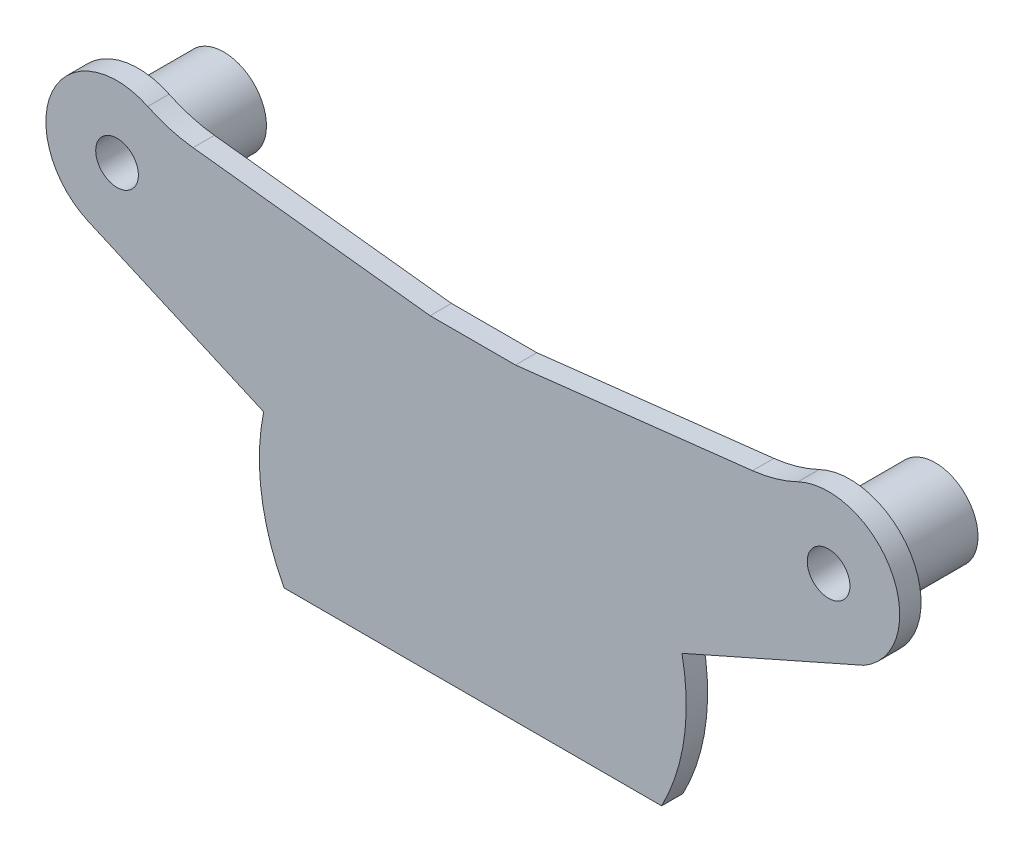
ISO-10303-21;
HEADER;
FILE_DESCRIPTION(('STEP AP214'),'2;1');
FILE_NAME('part.step','',(''),(''),'','','');
FILE_SCHEMA(('AUTOMOTIVE_DESIGN { 1 0 10303 214 1 1 1 1 }'));
ENDSEC;
DATA;
#1=APPLICATION_CONTEXT('core data for automotive mechanical design processes');
#2=APPLICATION_PROTOCOL_DEFINITION('international standard','automotive_design',2000,#1);
#3=PRODUCT_CONTEXT('',#1,'mechanical');
#4=PRODUCT('Part','Part','',(#3));
#5=PRODUCT_RELATED_PRODUCT_CATEGORY('part','',(#4));
#6=PRODUCT_DEFINITION_FORMATION('','',#4);
#7=PRODUCT_DEFINITION_CONTEXT('part definition',#1,'design');
#8=PRODUCT_DEFINITION('design','',#6,#7);
#9=PRODUCT_DEFINITION_SHAPE('','',#8);
#10=(LENGTH_UNIT() NAMED_UNIT(*) SI_UNIT(.MILLI.,.METRE.));
#11=(NAMED_UNIT(*) PLANE_ANGLE_UNIT() SI_UNIT($,.RADIAN.));
#12=(NAMED_UNIT(*) SI_UNIT($,.STERADIAN.) SOLID_ANGLE_UNIT());
#13=UNCERTAINTY_MEASURE_WITH_UNIT(LENGTH_MEASURE(1.E-05),#10,'distance_accuracy_value','');
#14=(GEOMETRIC_REPRESENTATION_CONTEXT(3) GLOBAL_UNCERTAINTY_ASSIGNED_CONTEXT((#13)) GLOBAL_UNIT_ASSIGNED_CONTEXT((#10,
#11,#12)) REPRESENTATION_CONTEXT('',''));
#15=CARTESIAN_POINT('',(0.,0.,0.));
#16=DIRECTION('',(0.,0.,1.));
#17=DIRECTION('',(1.,0.,0.));
#18=AXIS2_PLACEMENT_3D('',#15,#16,#17);
#19=CARTESIAN_POINT('',(0.,0.,0.));
#20=DIRECTION('',(0.,0.,1.));
#21=DIRECTION('',(1.,0.,0.));
#22=AXIS2_PLACEMENT_3D('',#19,#20,#21);
#23=PLANE('',#22);
#24=CARTESIAN_POINT('',(-25.,13.,0.));
#25=DIRECTION('',(0.,0.,1.));
#26=DIRECTION('',(1.,0.,0.));
#27=AXIS2_PLACEMENT_3D('',#24,#25,#26);
#28=CIRCLE('',#27,4.00000000000001);
#29=CARTESIAN_POINT('',(-21.,13.,0.));
#30=VERTEX_POINT('',#29);
#31=EDGE_CURVE('E45',#30,#30,#28,.T.);
#32=ORIENTED_EDGE('',*,*,#31,.T.);
#33=EDGE_LOOP('',(#32));
#34=FACE_BOUND('',#33,.T.);
#35=CARTESIAN_POINT('',(25.,13.,0.));
#36=DIRECTION('',(0.,0.,1.));
#37=DIRECTION('',(1.,0.,0.));
#38=AXIS2_PLACEMENT_3D('',#35,#36,#37);
#39=CIRCLE('',#38,4.00000000000001);
#40=CARTESIAN_POINT('',(29.,13.,0.));
#41=VERTEX_POINT('',#40);
#42=EDGE_CURVE('E217',#41,#41,#39,.T.);
#43=ORIENTED_EDGE('',*,*,#42,.T.);
#44=EDGE_LOOP('',(#43));
#45=FACE_BOUND('',#44,.T.);
#46=CARTESIAN_POINT('',(-18.5250325634357,26.5305135414526,0.));
#47=DIRECTION('',(0.,0.,1.));
#48=DIRECTION('',(1.,0.,0.));
#49=AXIS2_PLACEMENT_3D('',#46,#47,#48);
#50=CIRCLE('',#49,10.);
#51=CARTESIAN_POINT('',(-22.8416775211452,17.5101711804842,0.));
#52=VERTEX_POINT('',#51);
#53=CARTESIAN_POINT('',(-19.657078673607,16.5947965766611,0.));
#54=VERTEX_POINT('',#53);
#55=EDGE_CURVE('E163',#52,#54,#50,.T.);
#56=ORIENTED_EDGE('',*,*,#55,.T.);
#57=DIRECTION('',(0.993571696479152,-0.113204611017127,0.));
#58=VECTOR('',#57,1.);
#59=CARTESIAN_POINT('',(1.61462018727957,14.1711623248467,0.));
#60=LINE('',#59,#58);
#61=CARTESIAN_POINT('',(-3.,14.6969384566991,0.));
#62=VERTEX_POINT('',#61);
#63=EDGE_CURVE('E188',#54,#62,#60,.T.);
#64=ORIENTED_EDGE('',*,*,#63,.T.);
#65=DIRECTION('',(1.,0.,0.));
#66=VECTOR('',#65,1.);
#67=CARTESIAN_POINT('',(0.,14.6969384566991,0.));
#68=LINE('',#67,#66);
#69=CARTESIAN_POINT('',(3.,14.6969384566991,0.));
#70=VERTEX_POINT('',#69);
#71=EDGE_CURVE('E186',#62,#70,#68,.T.);
#72=ORIENTED_EDGE('',*,*,#71,.T.);
#73=DIRECTION('',(0.993571696479152,0.113204611017128,0.));
#74=VECTOR('',#73,1.);
#75=CARTESIAN_POINT('',(-1.61462018727957,14.1711623248467,0.));
#76=LINE('',#75,#74);
#77=CARTESIAN_POINT('',(19.657078673607,16.5947965766611,0.));
#78=VERTEX_POINT('',#77);
#79=EDGE_CURVE('E134',#70,#78,#76,.T.);
#80=ORIENTED_EDGE('',*,*,#79,.T.);
#81=CARTESIAN_POINT('',(18.5250325634357,26.5305135414526,0.));
#82=DIRECTION('',(0.,0.,1.));
#83=DIRECTION('',(1.,0.,0.));
#84=AXIS2_PLACEMENT_3D('',#81,#82,#83);
#85=CIRCLE('',#84,10.);
#86=CARTESIAN_POINT('',(22.8416775211452,17.5101711804842,0.));
#87=VERTEX_POINT('',#86);
#88=EDGE_CURVE('E182',#78,#87,#85,.T.);
#89=ORIENTED_EDGE('',*,*,#88,.T.);
#90=CARTESIAN_POINT('',(25.,13.,0.));
#91=DIRECTION('',(0.,0.,1.));
#92=DIRECTION('',(1.,0.,0.));
#93=AXIS2_PLACEMENT_3D('',#90,#91,#92);
#94=CIRCLE('',#93,5.);
#95=CARTESIAN_POINT('',(27.4936388626549,8.66620660129523,0.));
#96=VERTEX_POINT('',#95);
#97=EDGE_CURVE('E179',#96,#87,#94,.T.);
#98=ORIENTED_EDGE('',*,*,#97,.F.);
#99=DIRECTION('',(0.914373292540075,0.404872179693077,0.));
#100=VECTOR('',#99,1.);
#101=CARTESIAN_POINT('',(1.29853100704825,-2.9326343768055,0.));
#102=LINE('',#101,#100);
#103=CARTESIAN_POINT('',(14.6969384566991,3.,0.));
#104=VERTEX_POINT('',#103);
#105=EDGE_CURVE('E177',#104,#96,#102,.T.);
#106=ORIENTED_EDGE('',*,*,#105,.F.);
#107=CARTESIAN_POINT('',(0.,0.,0.));
#108=DIRECTION('',(0.,0.,1.));
#109=DIRECTION('',(1.,0.,0.));
#110=AXIS2_PLACEMENT_3D('',#107,#108,#109);
#111=CIRCLE('',#110,15.);
#112=CARTESIAN_POINT('',(13.2664991614216,-7.,0.));
#113=VERTEX_POINT('',#112);
#114=EDGE_CURVE('E175',#113,#104,#111,.T.);
#115=ORIENTED_EDGE('',*,*,#114,.F.);
#116=DIRECTION('',(1.,0.,0.));
#117=VECTOR('',#116,1.);
#118=CARTESIAN_POINT('',(0.,-7.,0.));
#119=LINE('',#118,#117);
#120=CARTESIAN_POINT('',(-13.2664991614216,-7.,0.));
#121=VERTEX_POINT('',#120);
#122=EDGE_CURVE('E174',#121,#113,#119,.T.);
#123=ORIENTED_EDGE('',*,*,#122,.F.);
#124=CARTESIAN_POINT('',(-14.6969384566991,3.,0.));
#125=VERTEX_POINT('',#124);
#126=EDGE_CURVE('E172',#125,#121,#111,.T.);
#127=ORIENTED_EDGE('',*,*,#126,.F.);
#128=DIRECTION('',(-0.915203990948097,0.402990886935022,0.));
#129=VECTOR('',#128,1.);
#130=CARTESIAN_POINT('',(-1.28035052398962,-2.90771317009142,0.));
#131=LINE('',#130,#129);
#132=CARTESIAN_POINT('',(-27.0149544346751,8.42398004525951,0.));
#133=VERTEX_POINT('',#132);
#134=EDGE_CURVE('E169',#125,#133,#131,.T.);
#135=ORIENTED_EDGE('',*,*,#134,.T.);
#136=CARTESIAN_POINT('',(-25.,13.,0.));
#137=DIRECTION('',(0.,0.,1.));
#138=DIRECTION('',(1.,0.,0.));
#139=AXIS2_PLACEMENT_3D('',#136,#137,#138);
#140=CIRCLE('',#139,5.);
#141=EDGE_CURVE('E165',#52,#133,#140,.T.);
#142=ORIENTED_EDGE('',*,*,#141,.F.);
#143=EDGE_LOOP('',(#56,#64,#72,#80,#89,#98,#106,#115,#123,#127,#135,#142));
#144=FACE_BOUND('',#143,.T.);
#145=ADVANCED_FACE('F36',(#34,#45,#144),#23,.F.);
#146=CARTESIAN_POINT('',(-18.5250325634357,26.5305135414526,1.5));
#147=DIRECTION('',(0.,0.,-1.));
#148=DIRECTION('',(-1.,0.,0.));
#149=AXIS2_PLACEMENT_3D('',#146,#147,#148);
#150=CYLINDRICAL_SURFACE('',#149,10.);
#151=ORIENTED_EDGE('',*,*,#55,.F.);
#152=DIRECTION('',(0.,0.,-1.));
#153=VECTOR('',#152,1.);
#154=CARTESIAN_POINT('',(-22.8416775211452,17.5101711804842,1.5));
#155=LINE('',#154,#153);
#156=CARTESIAN_POINT('',(-22.8416775211452,17.5101711804842,1.5));
#157=VERTEX_POINT('',#156);
#158=EDGE_CURVE('E100',#157,#52,#155,.T.);
#159=ORIENTED_EDGE('',*,*,#158,.F.);
#160=CARTESIAN_POINT('',(-18.5250325634357,26.5305135414526,1.5));
#161=DIRECTION('',(0.,0.,1.));
#162=DIRECTION('',(1.,0.,0.));
#163=AXIS2_PLACEMENT_3D('',#160,#161,#162);
#164=CIRCLE('',#163,10.);
#165=CARTESIAN_POINT('',(-19.657078673607,16.5947965766611,1.5));
#166=VERTEX_POINT('',#165);
#167=EDGE_CURVE('E191',#157,#166,#164,.T.);
#168=ORIENTED_EDGE('',*,*,#167,.T.);
#169=DIRECTION('',(0.,0.,-1.));
#170=VECTOR('',#169,1.);
#171=CARTESIAN_POINT('',(-19.657078673607,16.5947965766611,1.5));
#172=LINE('',#171,#170);
#173=EDGE_CURVE('E53',#166,#54,#172,.T.);
#174=ORIENTED_EDGE('',*,*,#173,.T.);
#175=EDGE_LOOP('',(#151,#159,#168,#174));
#176=FACE_BOUND('',#175,.T.);
#177=ADVANCED_FACE('F282',(#176),#150,.F.);
#178=CARTESIAN_POINT('',(-25.,13.,1.5));
#179=DIRECTION('',(0.,0.,-1.));
#180=DIRECTION('',(-1.,0.,0.));
#181=AXIS2_PLACEMENT_3D('',#178,#179,#180);
#182=CYLINDRICAL_SURFACE('',#181,5.);
#183=ORIENTED_EDGE('',*,*,#141,.T.);
#184=DIRECTION('',(0.,0.,-1.));
#185=VECTOR('',#184,1.);
#186=CARTESIAN_POINT('',(-27.0149544346751,8.42398004525951,1.5));
#187=LINE('',#186,#185);
#188=CARTESIAN_POINT('',(-27.0149544346751,8.42398004525951,1.5));
#189=VERTEX_POINT('',#188);
#190=EDGE_CURVE('E211',#189,#133,#187,.T.);
#191=ORIENTED_EDGE('',*,*,#190,.F.);
#192=CARTESIAN_POINT('',(-25.,13.,1.5));
#193=DIRECTION('',(0.,0.,1.));
#194=DIRECTION('',(1.,0.,0.));
#195=AXIS2_PLACEMENT_3D('',#192,#193,#194);
#196=CIRCLE('',#195,5.);
#197=EDGE_CURVE('E247',#157,#189,#196,.T.);
#198=ORIENTED_EDGE('',*,*,#197,.F.);
#199=ORIENTED_EDGE('',*,*,#158,.T.);
#200=EDGE_LOOP('',(#183,#191,#198,#199));
#201=FACE_BOUND('',#200,.T.);
#202=ADVANCED_FACE('F287',(#201),#182,.T.);
#203=CARTESIAN_POINT('',(-1.28035052398962,-2.90771317009142,1.5));
#204=DIRECTION('',(-0.402990886935022,-0.915203990948097,0.));
#205=DIRECTION('',(0.915203990948097,-0.402990886935022,0.));
#206=AXIS2_PLACEMENT_3D('',#203,#204,#205);
#207=PLANE('',#206);
#208=ORIENTED_EDGE('',*,*,#134,.F.);
#209=DIRECTION('',(0.,0.,-1.));
#210=VECTOR('',#209,1.);
#211=CARTESIAN_POINT('',(-14.6969384566991,3.,1.5));
#212=LINE('',#211,#210);
#213=CARTESIAN_POINT('',(-14.6969384566991,3.,1.5));
#214=VERTEX_POINT('',#213);
#215=EDGE_CURVE('E209',#214,#125,#212,.T.);
#216=ORIENTED_EDGE('',*,*,#215,.F.);
#217=DIRECTION('',(-0.915203990948097,0.402990886935022,0.));
#218=VECTOR('',#217,1.);
#219=CARTESIAN_POINT('',(-1.28035052398962,-2.90771317009142,1.5));
#220=LINE('',#219,#218);
#221=EDGE_CURVE('E249',#214,#189,#220,.T.);
#222=ORIENTED_EDGE('',*,*,#221,.T.);
#223=ORIENTED_EDGE('',*,*,#190,.T.);
#224=EDGE_LOOP('',(#208,#216,#222,#223));
#225=FACE_BOUND('',#224,.T.);
#226=ADVANCED_FACE('F450',(#225),#207,.T.);
#227=CARTESIAN_POINT('',(0.,0.,1.5));
#228=DIRECTION('',(0.,0.,-1.));
#229=DIRECTION('',(-1.,0.,0.));
#230=AXIS2_PLACEMENT_3D('',#227,#228,#229);
#231=CYLINDRICAL_SURFACE('',#230,15.);
#232=ORIENTED_EDGE('',*,*,#126,.T.);
#233=DIRECTION('',(0.,0.,-1.));
#234=VECTOR('',#233,1.);
#235=CARTESIAN_POINT('',(-13.2664991614216,-7.,1.5));
#236=LINE('',#235,#234);
#237=CARTESIAN_POINT('',(-13.2664991614216,-7.,1.5));
#238=VERTEX_POINT('',#237);
#239=EDGE_CURVE('E206',#238,#121,#236,.T.);
#240=ORIENTED_EDGE('',*,*,#239,.F.);
#241=CARTESIAN_POINT('',(0.,0.,1.5));
#242=DIRECTION('',(0.,0.,1.));
#243=DIRECTION('',(1.,0.,0.));
#244=AXIS2_PLACEMENT_3D('',#241,#242,#243);
#245=CIRCLE('',#244,15.);
#246=EDGE_CURVE('E252',#214,#238,#245,.T.);
#247=ORIENTED_EDGE('',*,*,#246,.F.);
#248=ORIENTED_EDGE('',*,*,#215,.T.);
#249=EDGE_LOOP('',(#232,#240,#247,#248));
#250=FACE_BOUND('',#249,.T.);
#251=ADVANCED_FACE('F433',(#250),#231,.T.);
#252=CARTESIAN_POINT('',(0.,-7.,1.5));
#253=DIRECTION('',(0.,1.,0.));
#254=DIRECTION('',(0.,0.,1.));
#255=AXIS2_PLACEMENT_3D('',#252,#253,#254);
#256=PLANE('',#255);
#257=ORIENTED_EDGE('',*,*,#122,.T.);
#258=DIRECTION('',(0.,0.,-1.));
#259=VECTOR('',#258,1.);
#260=CARTESIAN_POINT('',(13.2664991614216,-7.,1.5));
#261=LINE('',#260,#259);
#262=CARTESIAN_POINT('',(13.2664991614216,-7.,1.5));
#263=VERTEX_POINT('',#262);
#264=EDGE_CURVE('E203',#263,#113,#261,.T.);
#265=ORIENTED_EDGE('',*,*,#264,.F.);
#266=DIRECTION('',(1.,0.,0.));
#267=VECTOR('',#266,1.);
#268=CARTESIAN_POINT('',(0.,-7.,1.5));
#269=LINE('',#268,#267);
#270=EDGE_CURVE('E254',#238,#263,#269,.T.);
#271=ORIENTED_EDGE('',*,*,#270,.F.);
#272=ORIENTED_EDGE('',*,*,#239,.T.);
#273=EDGE_LOOP('',(#257,#265,#271,#272));
#274=FACE_BOUND('',#273,.T.);
#275=ADVANCED_FACE('F430',(#274),#256,.F.);
#276=ORIENTED_EDGE('',*,*,#114,.T.);
#277=DIRECTION('',(0.,0.,-1.));
#278=VECTOR('',#277,1.);
#279=CARTESIAN_POINT('',(14.6969384566991,3.,1.5));
#280=LINE('',#279,#278);
#281=CARTESIAN_POINT('',(14.6969384566991,3.,1.5));
#282=VERTEX_POINT('',#281);
#283=EDGE_CURVE('E200',#282,#104,#280,.T.);
#284=ORIENTED_EDGE('',*,*,#283,.F.);
#285=EDGE_CURVE('E255',#263,#282,#245,.T.);
#286=ORIENTED_EDGE('',*,*,#285,.F.);
#287=ORIENTED_EDGE('',*,*,#264,.T.);
#288=EDGE_LOOP('',(#276,#284,#286,#287));
#289=FACE_BOUND('',#288,.T.);
#290=ADVANCED_FACE('F420',(#289),#231,.T.);
#291=CARTESIAN_POINT('',(1.29853100704825,-2.9326343768055,1.5));
#292=DIRECTION('',(-0.404872179693076,0.914373292540075,0.));
#293=DIRECTION('',(-0.914373292540075,-0.404872179693077,0.));
#294=AXIS2_PLACEMENT_3D('',#291,#292,#293);
#295=PLANE('',#294);
#296=ORIENTED_EDGE('',*,*,#105,.T.);
#297=DIRECTION('',(0.,0.,-1.));
#298=VECTOR('',#297,1.);
#299=CARTESIAN_POINT('',(27.4936388626549,8.66620660129523,1.5));
#300=LINE('',#299,#298);
#301=CARTESIAN_POINT('',(27.4936388626549,8.66620660129523,1.5));
#302=VERTEX_POINT('',#301);
#303=EDGE_CURVE('E197',#302,#96,#300,.T.);
#304=ORIENTED_EDGE('',*,*,#303,.F.);
#305=DIRECTION('',(0.914373292540075,0.404872179693077,0.));
#306=VECTOR('',#305,1.);
#307=CARTESIAN_POINT('',(1.29853100704825,-2.9326343768055,1.5));
#308=LINE('',#307,#306);
#309=EDGE_CURVE('E257',#282,#302,#308,.T.);
#310=ORIENTED_EDGE('',*,*,#309,.F.);
#311=ORIENTED_EDGE('',*,*,#283,.T.);
#312=EDGE_LOOP('',(#296,#304,#310,#311));
#313=FACE_BOUND('',#312,.T.);
#314=ADVANCED_FACE('F410',(#313),#295,.F.);
#315=CARTESIAN_POINT('',(25.,13.,1.5));
#316=DIRECTION('',(0.,0.,-1.));
#317=DIRECTION('',(-1.,0.,0.));
#318=AXIS2_PLACEMENT_3D('',#315,#316,#317);
#319=CYLINDRICAL_SURFACE('',#318,5.);
#320=ORIENTED_EDGE('',*,*,#97,.T.);
#321=DIRECTION('',(0.,0.,-1.));
#322=VECTOR('',#321,1.);
#323=CARTESIAN_POINT('',(22.8416775211452,17.5101711804842,1.5));
#324=LINE('',#323,#322);
#325=CARTESIAN_POINT('',(22.8416775211452,17.5101711804842,1.5));
#326=VERTEX_POINT('',#325);
#327=EDGE_CURVE('E195',#326,#87,#324,.T.);
#328=ORIENTED_EDGE('',*,*,#327,.F.);
#329=CARTESIAN_POINT('',(25.,13.,1.5));
#330=DIRECTION('',(0.,0.,1.));
#331=DIRECTION('',(1.,0.,0.));
#332=AXIS2_PLACEMENT_3D('',#329,#330,#331);
#333=CIRCLE('',#332,5.);
#334=EDGE_CURVE('E259',#302,#326,#333,.T.);
#335=ORIENTED_EDGE('',*,*,#334,.F.);
#336=ORIENTED_EDGE('',*,*,#303,.T.);
#337=EDGE_LOOP('',(#320,#328,#335,#336));
#338=FACE_BOUND('',#337,.T.);
#339=ADVANCED_FACE('F401',(#338),#319,.T.);
#340=CARTESIAN_POINT('',(18.5250325634357,26.5305135414526,1.5));
#341=DIRECTION('',(0.,0.,-1.));
#342=DIRECTION('',(-1.,0.,0.));
#343=AXIS2_PLACEMENT_3D('',#340,#341,#342);
#344=CYLINDRICAL_SURFACE('',#343,10.);
#345=ORIENTED_EDGE('',*,*,#88,.F.);
#346=DIRECTION('',(0.,0.,-1.));
#347=VECTOR('',#346,1.);
#348=CARTESIAN_POINT('',(19.657078673607,16.5947965766611,1.5));
#349=LINE('',#348,#347);
#350=CARTESIAN_POINT('',(19.657078673607,16.5947965766611,1.5));
#351=VERTEX_POINT('',#350);
#352=EDGE_CURVE('E138',#351,#78,#349,.T.);
#353=ORIENTED_EDGE('',*,*,#352,.F.);
#354=CARTESIAN_POINT('',(18.5250325634357,26.5305135414526,1.5));
#355=DIRECTION('',(0.,0.,1.));
#356=DIRECTION('',(1.,0.,0.));
#357=AXIS2_PLACEMENT_3D('',#354,#355,#356);
#358=CIRCLE('',#357,10.);
#359=EDGE_CURVE('E149',#351,#326,#358,.T.);
#360=ORIENTED_EDGE('',*,*,#359,.T.);
#361=ORIENTED_EDGE('',*,*,#327,.T.);
#362=EDGE_LOOP('',(#345,#353,#360,#361));
#363=FACE_BOUND('',#362,.T.);
#364=ADVANCED_FACE('F262',(#363),#344,.F.);
#365=CARTESIAN_POINT('',(-1.61462018727957,14.1711623248467,1.5));
#366=DIRECTION('',(-0.113204611017128,0.993571696479152,0.));
#367=DIRECTION('',(-0.993571696479152,-0.113204611017128,0.));
#368=AXIS2_PLACEMENT_3D('',#365,#366,#367);
#369=PLANE('',#368);
#370=ORIENTED_EDGE('',*,*,#79,.F.);
#371=DIRECTION('',(0.,0.,-1.));
#372=VECTOR('',#371,1.);
#373=CARTESIAN_POINT('',(3.,14.6969384566991,1.5));
#374=LINE('',#373,#372);
#375=CARTESIAN_POINT('',(3.,14.6969384566991,1.5));
#376=VERTEX_POINT('',#375);
#377=EDGE_CURVE('E129',#376,#70,#374,.T.);
#378=ORIENTED_EDGE('',*,*,#377,.F.);
#379=DIRECTION('',(0.993571696479152,0.113204611017128,0.));
#380=VECTOR('',#379,1.);
#381=CARTESIAN_POINT('',(-1.61462018727957,14.1711623248467,1.5));
#382=LINE('',#381,#380);
#383=EDGE_CURVE('E132',#376,#351,#382,.T.);
#384=ORIENTED_EDGE('',*,*,#383,.T.);
#385=ORIENTED_EDGE('',*,*,#352,.T.);
#386=EDGE_LOOP('',(#370,#378,#384,#385));
#387=FACE_BOUND('',#386,.T.);
#388=ADVANCED_FACE('F131',(#387),#369,.T.);
#389=CARTESIAN_POINT('',(0.,14.6969384566991,1.5));
#390=DIRECTION('',(0.,1.,0.));
#391=DIRECTION('',(0.,0.,1.));
#392=AXIS2_PLACEMENT_3D('',#389,#390,#391);
#393=PLANE('',#392);
#394=ORIENTED_EDGE('',*,*,#71,.F.);
#395=DIRECTION('',(0.,0.,-1.));
#396=VECTOR('',#395,1.);
#397=CARTESIAN_POINT('',(-3.,14.6969384566991,1.5));
#398=LINE('',#397,#396);
#399=CARTESIAN_POINT('',(-3.,14.6969384566991,1.5));
#400=VERTEX_POINT('',#399);
#401=EDGE_CURVE('E91',#400,#62,#398,.T.);
#402=ORIENTED_EDGE('',*,*,#401,.F.);
#403=DIRECTION('',(1.,0.,0.));
#404=VECTOR('',#403,1.);
#405=CARTESIAN_POINT('',(0.,14.6969384566991,1.5));
#406=LINE('',#405,#404);
#407=EDGE_CURVE('E147',#400,#376,#406,.T.);
#408=ORIENTED_EDGE('',*,*,#407,.T.);
#409=ORIENTED_EDGE('',*,*,#377,.T.);
#410=EDGE_LOOP('',(#394,#402,#408,#409));
#411=FACE_BOUND('',#410,.T.);
#412=ADVANCED_FACE('F151',(#411),#393,.T.);
#413=CARTESIAN_POINT('',(25.,13.,1.5));
#414=DIRECTION('',(0.,0.,-1.));
#415=DIRECTION('',(-1.,0.,0.));
#416=AXIS2_PLACEMENT_3D('',#413,#414,#415);
#417=CYLINDRICAL_SURFACE('',#416,1.5);
#418=CARTESIAN_POINT('',(25.,13.,1.5));
#419=DIRECTION('',(0.,0.,1.));
#420=DIRECTION('',(1.,0.,0.));
#421=AXIS2_PLACEMENT_3D('',#418,#419,#420);
#422=CIRCLE('',#421,1.5);
#423=CARTESIAN_POINT('',(26.5,13.,1.5));
#424=VERTEX_POINT('',#423);
#425=EDGE_CURVE('E154',#424,#424,#422,.T.);
#426=ORIENTED_EDGE('',*,*,#425,.T.);
#427=EDGE_LOOP('',(#426));
#428=FACE_BOUND('',#427,.T.);
#429=CARTESIAN_POINT('',(25.,13.,-6.));
#430=DIRECTION('',(0.,0.,-1.));
#431=DIRECTION('',(1.,0.,0.));
#432=AXIS2_PLACEMENT_3D('',#429,#430,#431);
#433=CIRCLE('',#432,1.5);
#434=CARTESIAN_POINT('',(26.5,13.,-6.));
#435=VERTEX_POINT('',#434);
#436=EDGE_CURVE('E306',#435,#435,#433,.T.);
#437=ORIENTED_EDGE('',*,*,#436,.T.);
#438=EDGE_LOOP('',(#437));
#439=FACE_BOUND('',#438,.T.);
#440=ADVANCED_FACE('F270',(#428,#439),#417,.F.);
#441=CARTESIAN_POINT('',(1.61462018727957,14.1711623248467,1.5));
#442=DIRECTION('',(0.113204611017127,0.993571696479152,0.));
#443=DIRECTION('',(-0.993571696479153,0.113204611017127,0.));
#444=AXIS2_PLACEMENT_3D('',#441,#442,#443);
#445=PLANE('',#444);
#446=ORIENTED_EDGE('',*,*,#63,.F.);
#447=ORIENTED_EDGE('',*,*,#173,.F.);
#448=DIRECTION('',(0.993571696479152,-0.113204611017127,0.));
#449=VECTOR('',#448,1.);
#450=CARTESIAN_POINT('',(1.61462018727957,14.1711623248467,1.5));
#451=LINE('',#450,#449);
#452=EDGE_CURVE('E152',#166,#400,#451,.T.);
#453=ORIENTED_EDGE('',*,*,#452,.T.);
#454=ORIENTED_EDGE('',*,*,#401,.T.);
#455=EDGE_LOOP('',(#446,#447,#453,#454));
#456=FACE_BOUND('',#455,.T.);
#457=ADVANCED_FACE('F267',(#456),#445,.T.);
#458=CARTESIAN_POINT('',(-25.,13.,1.5));
#459=DIRECTION('',(0.,0.,-1.));
#460=DIRECTION('',(-1.,0.,0.));
#461=AXIS2_PLACEMENT_3D('',#458,#459,#460);
#462=CYLINDRICAL_SURFACE('',#461,1.5);
#463=CARTESIAN_POINT('',(-25.,13.,1.5));
#464=DIRECTION('',(0.,0.,1.));
#465=DIRECTION('',(1.,0.,0.));
#466=AXIS2_PLACEMENT_3D('',#463,#464,#465);
#467=CIRCLE('',#466,1.5);
#468=CARTESIAN_POINT('',(-23.5,13.,1.5));
#469=VERTEX_POINT('',#468);
#470=EDGE_CURVE('E160',#469,#469,#467,.T.);
#471=ORIENTED_EDGE('',*,*,#470,.T.);
#472=EDGE_LOOP('',(#471));
#473=FACE_BOUND('',#472,.T.);
#474=CARTESIAN_POINT('',(-25.,13.,-6.));
#475=DIRECTION('',(0.,0.,-1.));
#476=DIRECTION('',(-1.,0.,0.));
#477=AXIS2_PLACEMENT_3D('',#474,#475,#476);
#478=CIRCLE('',#477,1.5);
#479=CARTESIAN_POINT('',(-26.5,13.,-6.));
#480=VERTEX_POINT('',#479);
#481=EDGE_CURVE('E239',#480,#480,#478,.T.);
#482=ORIENTED_EDGE('',*,*,#481,.T.);
#483=EDGE_LOOP('',(#482));
#484=FACE_BOUND('',#483,.T.);
#485=ADVANCED_FACE('F269',(#473,#484),#462,.F.);
#486=CARTESIAN_POINT('',(0.,0.,1.5));
#487=DIRECTION('',(0.,0.,1.));
#488=DIRECTION('',(1.,0.,0.));
#489=AXIS2_PLACEMENT_3D('',#486,#487,#488);
#490=PLANE('',#489);
#491=ORIENTED_EDGE('',*,*,#167,.F.);
#492=ORIENTED_EDGE('',*,*,#197,.T.);
#493=ORIENTED_EDGE('',*,*,#221,.F.);
#494=ORIENTED_EDGE('',*,*,#246,.T.);
#495=ORIENTED_EDGE('',*,*,#270,.T.);
#496=ORIENTED_EDGE('',*,*,#285,.T.);
#497=ORIENTED_EDGE('',*,*,#309,.T.);
#498=ORIENTED_EDGE('',*,*,#334,.T.);
#499=ORIENTED_EDGE('',*,*,#359,.F.);
#500=ORIENTED_EDGE('',*,*,#383,.F.);
#501=ORIENTED_EDGE('',*,*,#407,.F.);
#502=ORIENTED_EDGE('',*,*,#452,.F.);
#503=EDGE_LOOP('',(#491,#492,#493,#494,#495,#496,#497,#498,#499,#500,#501,#502));
#504=FACE_BOUND('',#503,.T.);
#505=ORIENTED_EDGE('',*,*,#425,.F.);
#506=EDGE_LOOP('',(#505));
#507=FACE_BOUND('',#506,.T.);
#508=ORIENTED_EDGE('',*,*,#470,.F.);
#509=EDGE_LOOP('',(#508));
#510=FACE_BOUND('',#509,.T.);
#511=ADVANCED_FACE('F144',(#504,#507,#510),#490,.T.);
#512=CARTESIAN_POINT('',(-25.,13.,-6.));
#513=DIRECTION('',(0.,0.,-1.));
#514=DIRECTION('',(-1.,0.,0.));
#515=AXIS2_PLACEMENT_3D('',#512,#513,#514);
#516=PLANE('',#515);
#517=CARTESIAN_POINT('',(-25.,13.,-6.));
#518=DIRECTION('',(0.,0.,-1.));
#519=DIRECTION('',(-1.,0.,0.));
#520=AXIS2_PLACEMENT_3D('',#517,#518,#519);
#521=CIRCLE('',#520,3.);
#522=CARTESIAN_POINT('',(-28.,13.,-6.));
#523=VERTEX_POINT('',#522);
#524=EDGE_CURVE('E166',#523,#523,#521,.T.);
#525=ORIENTED_EDGE('',*,*,#524,.T.);
#526=EDGE_LOOP('',(#525));
#527=FACE_BOUND('',#526,.T.);
#528=ORIENTED_EDGE('',*,*,#481,.F.);
#529=EDGE_LOOP('',(#528));
#530=FACE_BOUND('',#529,.T.);
#531=ADVANCED_FACE('F234',(#527,#530),#516,.T.);
#532=CARTESIAN_POINT('',(-25.,13.,-6.));
#533=DIRECTION('',(0.,0.,1.));
#534=DIRECTION('',(1.,0.,0.));
#535=AXIS2_PLACEMENT_3D('',#532,#533,#534);
#536=CYLINDRICAL_SURFACE('',#535,3.);
#537=CARTESIAN_POINT('',(-25.,13.,-1.));
#538=DIRECTION('',(0.,0.,1.));
#539=DIRECTION('',(1.,0.,0.));
#540=AXIS2_PLACEMENT_3D('',#537,#538,#539);
#541=CIRCLE('',#540,3.);
#542=CARTESIAN_POINT('',(-22.,13.,-1.));
#543=VERTEX_POINT('',#542);
#544=EDGE_CURVE('E214',#543,#543,#541,.F.);
#545=ORIENTED_EDGE('',*,*,#544,.T.);
#546=EDGE_LOOP('',(#545));
#547=FACE_BOUND('',#546,.T.);
#548=ORIENTED_EDGE('',*,*,#524,.F.);
#549=EDGE_LOOP('',(#548));
#550=FACE_BOUND('',#549,.T.);
#551=ADVANCED_FACE('F230',(#547,#550),#536,.T.);
#552=CARTESIAN_POINT('',(25.,13.,-6.));
#553=DIRECTION('',(0.,0.,1.));
#554=DIRECTION('',(1.,0.,0.));
#555=AXIS2_PLACEMENT_3D('',#552,#553,#554);
#556=PLANE('',#555);
#557=CARTESIAN_POINT('',(25.,13.,-6.));
#558=DIRECTION('',(0.,0.,-1.));
#559=DIRECTION('',(1.,0.,0.));
#560=AXIS2_PLACEMENT_3D('',#557,#558,#559);
#561=CIRCLE('',#560,3.);
#562=CARTESIAN_POINT('',(28.,13.,-6.));
#563=VERTEX_POINT('',#562);
#564=EDGE_CURVE('E242',#563,#563,#561,.T.);
#565=ORIENTED_EDGE('',*,*,#564,.T.);
#566=EDGE_LOOP('',(#565));
#567=FACE_BOUND('',#566,.T.);
#568=ORIENTED_EDGE('',*,*,#436,.F.);
#569=EDGE_LOOP('',(#568));
#570=FACE_BOUND('',#569,.T.);
#571=ADVANCED_FACE('F233',(#567,#570),#556,.F.);
#572=CARTESIAN_POINT('',(25.,13.,-6.));
#573=DIRECTION('',(0.,0.,1.));
#574=DIRECTION('',(1.,0.,0.));
#575=AXIS2_PLACEMENT_3D('',#572,#573,#574);
#576=CYLINDRICAL_SURFACE('',#575,3.);
#577=CARTESIAN_POINT('',(25.,13.,-1.));
#578=DIRECTION('',(0.,0.,1.));
#579=DIRECTION('',(1.,0.,0.));
#580=AXIS2_PLACEMENT_3D('',#577,#578,#579);
#581=CIRCLE('',#580,3.);
#582=CARTESIAN_POINT('',(28.,13.,-1.));
#583=VERTEX_POINT('',#582);
#584=EDGE_CURVE('E11',#583,#583,#581,.F.);
#585=ORIENTED_EDGE('',*,*,#584,.T.);
#586=EDGE_LOOP('',(#585));
#587=FACE_BOUND('',#586,.T.);
#588=ORIENTED_EDGE('',*,*,#564,.F.);
#589=EDGE_LOOP('',(#588));
#590=FACE_BOUND('',#589,.T.);
#591=ADVANCED_FACE('F227',(#587,#590),#576,.T.);
#592=CARTESIAN_POINT('',(-25.,13.,-1.));
#593=DIRECTION('',(0.,0.,1.));
#594=DIRECTION('',(1.,0.,0.));
#595=AXIS2_PLACEMENT_3D('',#592,#593,#594);
#596=TOROIDAL_SURFACE('',#595,4.00000000000001,1.);
#597=ORIENTED_EDGE('',*,*,#31,.F.);
#598=EDGE_LOOP('',(#597));
#599=FACE_BOUND('',#598,.T.);
#600=ORIENTED_EDGE('',*,*,#544,.F.);
#601=EDGE_LOOP('',(#600));
#602=FACE_BOUND('',#601,.T.);
#603=ADVANCED_FACE('F224',(#599,#602),#596,.F.);
#604=CARTESIAN_POINT('',(25.,13.,-1.));
#605=DIRECTION('',(0.,0.,1.));
#606=DIRECTION('',(1.,0.,0.));
#607=AXIS2_PLACEMENT_3D('',#604,#605,#606);
#608=TOROIDAL_SURFACE('',#607,4.00000000000001,1.);
#609=ORIENTED_EDGE('',*,*,#42,.F.);
#610=EDGE_LOOP('',(#609));
#611=FACE_BOUND('',#610,.T.);
#612=ORIENTED_EDGE('',*,*,#584,.F.);
#613=EDGE_LOOP('',(#612));
#614=FACE_BOUND('',#613,.T.);
#615=ADVANCED_FACE('F38',(#611,#614),#608,.F.);
#616=CLOSED_SHELL('',(#145,#177,#202,#226,#251,#275,#290,#314,#339,#364,#388,#412,#440,#457,
#485,#511,#531,#551,#571,#591,#603,#615));
#617=MANIFOLD_SOLID_BREP('B2',#616);
#618=ADVANCED_BREP_SHAPE_REPRESENTATION('',(#18,#617),#14);
#619=SHAPE_DEFINITION_REPRESENTATION(#9,#618);
ENDSEC;
END-ISO-10303-21;
